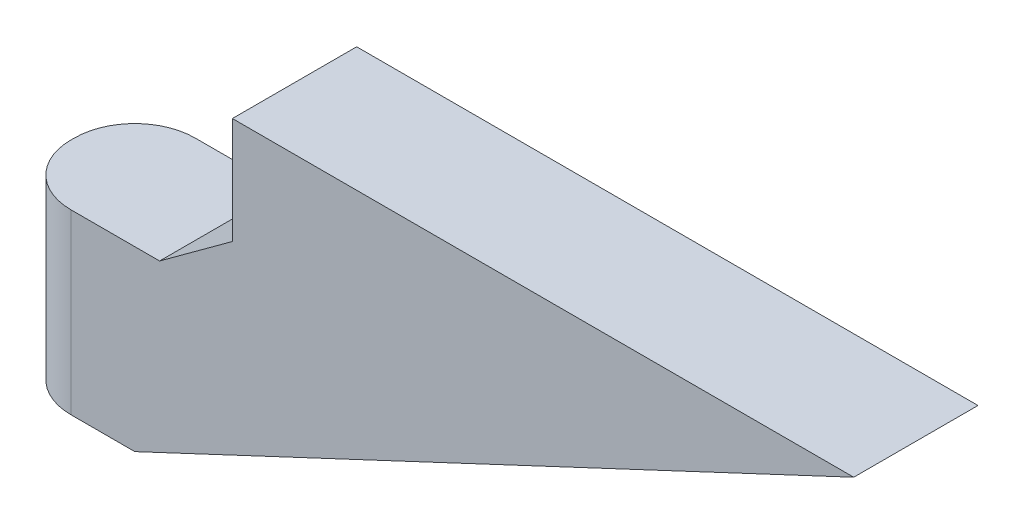
ISO-10303-21;
HEADER;
FILE_DESCRIPTION(('STEP AP214'),'2;1');
FILE_NAME('part.step','',(''),(''),'','','');
FILE_SCHEMA(('AUTOMOTIVE_DESIGN { 1 0 10303 214 1 1 1 1 }'));
ENDSEC;
DATA;
#1=APPLICATION_CONTEXT('core data for automotive mechanical design processes');
#2=APPLICATION_PROTOCOL_DEFINITION('international standard','automotive_design',2000,#1);
#3=PRODUCT_CONTEXT('',#1,'mechanical');
#4=PRODUCT('Part','Part','',(#3));
#5=PRODUCT_RELATED_PRODUCT_CATEGORY('part','',(#4));
#6=PRODUCT_DEFINITION_FORMATION('','',#4);
#7=PRODUCT_DEFINITION_CONTEXT('part definition',#1,'design');
#8=PRODUCT_DEFINITION('design','',#6,#7);
#9=PRODUCT_DEFINITION_SHAPE('','',#8);
#10=(LENGTH_UNIT() NAMED_UNIT(*) SI_UNIT(.MILLI.,.METRE.));
#11=(NAMED_UNIT(*) PLANE_ANGLE_UNIT() SI_UNIT($,.RADIAN.));
#12=(NAMED_UNIT(*) SI_UNIT($,.STERADIAN.) SOLID_ANGLE_UNIT());
#13=UNCERTAINTY_MEASURE_WITH_UNIT(LENGTH_MEASURE(1.E-05),#10,'distance_accuracy_value','');
#14=(GEOMETRIC_REPRESENTATION_CONTEXT(3) GLOBAL_UNCERTAINTY_ASSIGNED_CONTEXT((#13)) GLOBAL_UNIT_ASSIGNED_CONTEXT((#10,
#11,#12)) REPRESENTATION_CONTEXT('',''));
#15=CARTESIAN_POINT('',(0.,0.,0.));
#16=DIRECTION('',(0.,0.,1.));
#17=DIRECTION('',(1.,0.,0.));
#18=AXIS2_PLACEMENT_3D('',#15,#16,#17);
#19=CARTESIAN_POINT('',(0.,-12.065,8.89));
#20=DIRECTION('',(0.,-1.,0.));
#21=DIRECTION('',(1.,0.,0.));
#22=AXIS2_PLACEMENT_3D('',#19,#20,#21);
#23=PLANE('',#22);
#24=DIRECTION('',(0.,0.,-1.));
#25=VECTOR('',#24,1.);
#26=CARTESIAN_POINT('',(-30.1625,-12.065,8.89));
#27=LINE('',#26,#25);
#28=CARTESIAN_POINT('',(-30.1625,-12.065,4.572));
#29=VERTEX_POINT('',#28);
#30=CARTESIAN_POINT('',(-30.1625,-12.065,4.318));
#31=VERTEX_POINT('',#30);
#32=EDGE_CURVE('E148',#29,#31,#27,.T.);
#33=ORIENTED_EDGE('',*,*,#32,.T.);
#34=CARTESIAN_POINT('',(-25.8445,-12.065,4.318));
#35=DIRECTION('',(0.,-1.,0.));
#36=DIRECTION('',(1.,0.,0.));
#37=AXIS2_PLACEMENT_3D('',#34,#35,#36);
#38=CIRCLE('',#37,4.318);
#39=CARTESIAN_POINT('',(-25.8445,-12.065,0.));
#40=VERTEX_POINT('',#39);
#41=EDGE_CURVE('E178',#31,#40,#38,.T.);
#42=ORIENTED_EDGE('',*,*,#41,.T.);
#43=DIRECTION('',(-1.,0.,0.));
#44=VECTOR('',#43,1.);
#45=CARTESIAN_POINT('',(0.,-12.065,0.));
#46=LINE('',#45,#44);
#47=CARTESIAN_POINT('',(-21.2725,-12.065,0.));
#48=VERTEX_POINT('',#47);
#49=EDGE_CURVE('E119',#48,#40,#46,.T.);
#50=ORIENTED_EDGE('',*,*,#49,.F.);
#51=DIRECTION('',(0.,0.,-1.));
#52=VECTOR('',#51,1.);
#53=CARTESIAN_POINT('',(-21.2725,-12.065,8.89));
#54=LINE('',#53,#52);
#55=CARTESIAN_POINT('',(-21.2725,-12.065,8.89));
#56=VERTEX_POINT('',#55);
#57=EDGE_CURVE('E114',#56,#48,#54,.T.);
#58=ORIENTED_EDGE('',*,*,#57,.F.);
#59=DIRECTION('',(-1.,0.,0.));
#60=VECTOR('',#59,1.);
#61=CARTESIAN_POINT('',(0.,-12.065,8.89));
#62=LINE('',#61,#60);
#63=CARTESIAN_POINT('',(-25.8445,-12.065,8.89));
#64=VERTEX_POINT('',#63);
#65=EDGE_CURVE('E118',#56,#64,#62,.T.);
#66=ORIENTED_EDGE('',*,*,#65,.T.);
#67=CARTESIAN_POINT('',(-25.8445,-12.065,4.572));
#68=DIRECTION('',(0.,-1.,0.));
#69=DIRECTION('',(1.,0.,0.));
#70=AXIS2_PLACEMENT_3D('',#67,#68,#69);
#71=CIRCLE('',#70,4.318);
#72=EDGE_CURVE('E176',#64,#29,#71,.T.);
#73=ORIENTED_EDGE('',*,*,#72,.T.);
#74=EDGE_LOOP('',(#33,#42,#50,#58,#66,#73));
#75=FACE_BOUND('',#74,.T.);
#76=ADVANCED_FACE('F41',(#75),#23,.T.);
#77=CARTESIAN_POINT('',(0.80182136164897,-1.70914553404122,8.89));
#78=DIRECTION('',(-0.424720211390714,0.905324661122311,0.));
#79=DIRECTION('',(-0.905324661122311,-0.424720211390714,0.));
#80=AXIS2_PLACEMENT_3D('',#77,#78,#79);
#81=PLANE('',#80);
#82=DIRECTION('',(0.905324661122311,0.424720211390714,0.));
#83=VECTOR('',#82,1.);
#84=CARTESIAN_POINT('',(0.80182136164897,-1.70914553404122,0.));
#85=LINE('',#84,#83);
#86=CARTESIAN_POINT('',(30.1625,12.065,0.));
#87=VERTEX_POINT('',#86);
#88=EDGE_CURVE('E150',#48,#87,#85,.T.);
#89=ORIENTED_EDGE('',*,*,#88,.T.);
#90=DIRECTION('',(0.,0.,-1.));
#91=VECTOR('',#90,1.);
#92=CARTESIAN_POINT('',(30.1625,12.065,8.89));
#93=LINE('',#92,#91);
#94=CARTESIAN_POINT('',(30.1625,12.065,8.89));
#95=VERTEX_POINT('',#94);
#96=EDGE_CURVE('E123',#95,#87,#93,.T.);
#97=ORIENTED_EDGE('',*,*,#96,.F.);
#98=DIRECTION('',(0.905324661122311,0.424720211390714,0.));
#99=VECTOR('',#98,1.);
#100=CARTESIAN_POINT('',(0.80182136164897,-1.70914553404122,8.89));
#101=LINE('',#100,#99);
#102=EDGE_CURVE('E126',#56,#95,#101,.T.);
#103=ORIENTED_EDGE('',*,*,#102,.F.);
#104=ORIENTED_EDGE('',*,*,#57,.T.);
#105=EDGE_LOOP('',(#89,#97,#103,#104));
#106=FACE_BOUND('',#105,.T.);
#107=ADVANCED_FACE('F127',(#106),#81,.F.);
#108=CARTESIAN_POINT('',(0.,12.065,8.89));
#109=DIRECTION('',(0.,-1.,0.));
#110=DIRECTION('',(1.,0.,0.));
#111=AXIS2_PLACEMENT_3D('',#108,#109,#110);
#112=PLANE('',#111);
#113=DIRECTION('',(-1.,0.,0.));
#114=VECTOR('',#113,1.);
#115=CARTESIAN_POINT('',(0.,12.065,0.));
#116=LINE('',#115,#114);
#117=CARTESIAN_POINT('',(-14.2875,12.065,0.));
#118=VERTEX_POINT('',#117);
#119=EDGE_CURVE('E152',#87,#118,#116,.T.);
#120=ORIENTED_EDGE('',*,*,#119,.T.);
#121=DIRECTION('',(0.,0.,-1.));
#122=VECTOR('',#121,1.);
#123=CARTESIAN_POINT('',(-14.2875,12.065,8.89));
#124=LINE('',#123,#122);
#125=CARTESIAN_POINT('',(-14.2875,12.065,8.89));
#126=VERTEX_POINT('',#125);
#127=EDGE_CURVE('E168',#126,#118,#124,.T.);
#128=ORIENTED_EDGE('',*,*,#127,.F.);
#129=DIRECTION('',(-1.,0.,0.));
#130=VECTOR('',#129,1.);
#131=CARTESIAN_POINT('',(0.,12.065,8.89));
#132=LINE('',#131,#130);
#133=EDGE_CURVE('E131',#95,#126,#132,.T.);
#134=ORIENTED_EDGE('',*,*,#133,.F.);
#135=ORIENTED_EDGE('',*,*,#96,.T.);
#136=EDGE_LOOP('',(#120,#128,#134,#135));
#137=FACE_BOUND('',#136,.T.);
#138=ADVANCED_FACE('F194',(#137),#112,.F.);
#139=CARTESIAN_POINT('',(-14.2875,0.,8.89));
#140=DIRECTION('',(1.,0.,0.));
#141=DIRECTION('',(0.,1.,0.));
#142=AXIS2_PLACEMENT_3D('',#139,#140,#141);
#143=PLANE('',#142);
#144=DIRECTION('',(0.,-1.,0.));
#145=VECTOR('',#144,1.);
#146=CARTESIAN_POINT('',(-14.2875,0.,0.));
#147=LINE('',#146,#145);
#148=CARTESIAN_POINT('',(-14.2875,4.445,0.));
#149=VERTEX_POINT('',#148);
#150=EDGE_CURVE('E154',#118,#149,#147,.T.);
#151=ORIENTED_EDGE('',*,*,#150,.T.);
#152=DIRECTION('',(0.,0.,-1.));
#153=VECTOR('',#152,1.);
#154=CARTESIAN_POINT('',(-14.2875,4.445,8.89));
#155=LINE('',#154,#153);
#156=CARTESIAN_POINT('',(-14.2875,4.445,8.89));
#157=VERTEX_POINT('',#156);
#158=EDGE_CURVE('E165',#157,#149,#155,.T.);
#159=ORIENTED_EDGE('',*,*,#158,.F.);
#160=DIRECTION('',(0.,-1.,0.));
#161=VECTOR('',#160,1.);
#162=CARTESIAN_POINT('',(-14.2875,0.,8.89));
#163=LINE('',#162,#161);
#164=EDGE_CURVE('E141',#126,#157,#163,.T.);
#165=ORIENTED_EDGE('',*,*,#164,.F.);
#166=ORIENTED_EDGE('',*,*,#127,.T.);
#167=EDGE_LOOP('',(#151,#159,#165,#166));
#168=FACE_BOUND('',#167,.T.);
#169=ADVANCED_FACE('F201',(#168),#143,.F.);
#170=CARTESIAN_POINT('',(-7.10038744672608,9.70386284385897,8.89));
#171=DIRECTION('',(0.590509994384218,-0.80703032565843,0.));
#172=DIRECTION('',(0.80703032565843,0.590509994384218,0.));
#173=AXIS2_PLACEMENT_3D('',#170,#171,#172);
#174=PLANE('',#173);
#175=DIRECTION('',(-0.80703032565843,-0.590509994384218,0.));
#176=VECTOR('',#175,1.);
#177=CARTESIAN_POINT('',(-7.10038744672608,9.70386284385897,0.));
#178=LINE('',#177,#176);
#179=CARTESIAN_POINT('',(-19.4945,0.634999999999997,0.));
#180=VERTEX_POINT('',#179);
#181=EDGE_CURVE('E137',#149,#180,#178,.T.);
#182=ORIENTED_EDGE('',*,*,#181,.T.);
#183=DIRECTION('',(0.,0.,-1.));
#184=VECTOR('',#183,1.);
#185=CARTESIAN_POINT('',(-19.4945,0.634999999999997,8.89));
#186=LINE('',#185,#184);
#187=CARTESIAN_POINT('',(-19.4945,0.634999999999997,8.89));
#188=VERTEX_POINT('',#187);
#189=EDGE_CURVE('E162',#188,#180,#186,.T.);
#190=ORIENTED_EDGE('',*,*,#189,.F.);
#191=DIRECTION('',(-0.80703032565843,-0.590509994384218,0.));
#192=VECTOR('',#191,1.);
#193=CARTESIAN_POINT('',(-7.10038744672608,9.70386284385897,8.89));
#194=LINE('',#193,#192);
#195=EDGE_CURVE('E143',#157,#188,#194,.T.);
#196=ORIENTED_EDGE('',*,*,#195,.F.);
#197=ORIENTED_EDGE('',*,*,#158,.T.);
#198=EDGE_LOOP('',(#182,#190,#196,#197));
#199=FACE_BOUND('',#198,.T.);
#200=ADVANCED_FACE('F204',(#199),#174,.F.);
#201=CARTESIAN_POINT('',(0.,0.634999999999997,8.89));
#202=DIRECTION('',(0.,1.,0.));
#203=DIRECTION('',(0.,0.,1.));
#204=AXIS2_PLACEMENT_3D('',#201,#202,#203);
#205=PLANE('',#204);
#206=DIRECTION('',(1.,0.,0.));
#207=VECTOR('',#206,1.);
#208=CARTESIAN_POINT('',(0.,0.634999999999997,0.));
#209=LINE('',#208,#207);
#210=CARTESIAN_POINT('',(-25.8445,0.634999999999997,0.));
#211=VERTEX_POINT('',#210);
#212=EDGE_CURVE('E135',#211,#180,#209,.T.);
#213=ORIENTED_EDGE('',*,*,#212,.F.);
#214=CARTESIAN_POINT('',(-25.8445,0.634999999999997,4.318));
#215=DIRECTION('',(0.,1.,0.));
#216=DIRECTION('',(0.,0.,1.));
#217=AXIS2_PLACEMENT_3D('',#214,#215,#216);
#218=CIRCLE('',#217,4.318);
#219=CARTESIAN_POINT('',(-30.1625,0.634999999999997,4.318));
#220=VERTEX_POINT('',#219);
#221=EDGE_CURVE('E49',#211,#220,#218,.T.);
#222=ORIENTED_EDGE('',*,*,#221,.T.);
#223=DIRECTION('',(0.,0.,-1.));
#224=VECTOR('',#223,1.);
#225=CARTESIAN_POINT('',(-30.1625,0.634999999999997,8.89));
#226=LINE('',#225,#224);
#227=CARTESIAN_POINT('',(-30.1625,0.634999999999997,4.572));
#228=VERTEX_POINT('',#227);
#229=EDGE_CURVE('E159',#228,#220,#226,.T.);
#230=ORIENTED_EDGE('',*,*,#229,.F.);
#231=CARTESIAN_POINT('',(-25.8445,0.634999999999997,4.572));
#232=DIRECTION('',(0.,1.,0.));
#233=DIRECTION('',(0.,0.,1.));
#234=AXIS2_PLACEMENT_3D('',#231,#232,#233);
#235=CIRCLE('',#234,4.318);
#236=CARTESIAN_POINT('',(-25.8445,0.634999999999997,8.89));
#237=VERTEX_POINT('',#236);
#238=EDGE_CURVE('E56',#228,#237,#235,.T.);
#239=ORIENTED_EDGE('',*,*,#238,.T.);
#240=DIRECTION('',(1.,0.,0.));
#241=VECTOR('',#240,1.);
#242=CARTESIAN_POINT('',(0.,0.634999999999997,8.89));
#243=LINE('',#242,#241);
#244=EDGE_CURVE('E146',#237,#188,#243,.T.);
#245=ORIENTED_EDGE('',*,*,#244,.T.);
#246=ORIENTED_EDGE('',*,*,#189,.T.);
#247=EDGE_LOOP('',(#213,#222,#230,#239,#245,#246));
#248=FACE_BOUND('',#247,.T.);
#249=ADVANCED_FACE('F182',(#248),#205,.T.);
#250=CARTESIAN_POINT('',(-30.1625,0.,8.89));
#251=DIRECTION('',(1.,0.,0.));
#252=DIRECTION('',(0.,1.,0.));
#253=AXIS2_PLACEMENT_3D('',#250,#251,#252);
#254=PLANE('',#253);
#255=ORIENTED_EDGE('',*,*,#229,.T.);
#256=DIRECTION('',(0.,-1.,0.));
#257=VECTOR('',#256,1.);
#258=CARTESIAN_POINT('',(-30.1625,0.,4.318));
#259=LINE('',#258,#257);
#260=EDGE_CURVE('E173',#220,#31,#259,.T.);
#261=ORIENTED_EDGE('',*,*,#260,.T.);
#262=ORIENTED_EDGE('',*,*,#32,.F.);
#263=DIRECTION('',(0.,-1.,0.));
#264=VECTOR('',#263,1.);
#265=CARTESIAN_POINT('',(-30.1625,0.634999999999997,4.572));
#266=LINE('',#265,#264);
#267=EDGE_CURVE('E122',#29,#228,#266,.F.);
#268=ORIENTED_EDGE('',*,*,#267,.T.);
#269=EDGE_LOOP('',(#255,#261,#262,#268));
#270=FACE_BOUND('',#269,.T.);
#271=ADVANCED_FACE('F186',(#270),#254,.F.);
#272=CARTESIAN_POINT('',(0.,0.,8.89));
#273=DIRECTION('',(0.,0.,1.));
#274=DIRECTION('',(1.,0.,0.));
#275=AXIS2_PLACEMENT_3D('',#272,#273,#274);
#276=PLANE('',#275);
#277=ORIENTED_EDGE('',*,*,#244,.F.);
#278=DIRECTION('',(0.,-1.,0.));
#279=VECTOR('',#278,1.);
#280=CARTESIAN_POINT('',(-25.8445,-12.065,8.89));
#281=LINE('',#280,#279);
#282=EDGE_CURVE('E11',#237,#64,#281,.T.);
#283=ORIENTED_EDGE('',*,*,#282,.T.);
#284=ORIENTED_EDGE('',*,*,#65,.F.);
#285=ORIENTED_EDGE('',*,*,#102,.T.);
#286=ORIENTED_EDGE('',*,*,#133,.T.);
#287=ORIENTED_EDGE('',*,*,#164,.T.);
#288=ORIENTED_EDGE('',*,*,#195,.T.);
#289=EDGE_LOOP('',(#277,#283,#284,#285,#286,#287,#288));
#290=FACE_BOUND('',#289,.T.);
#291=ADVANCED_FACE('F133',(#290),#276,.T.);
#292=CARTESIAN_POINT('',(0.,0.,0.));
#293=DIRECTION('',(0.,0.,1.));
#294=DIRECTION('',(1.,0.,0.));
#295=AXIS2_PLACEMENT_3D('',#292,#293,#294);
#296=PLANE('',#295);
#297=ORIENTED_EDGE('',*,*,#49,.T.);
#298=DIRECTION('',(0.,-1.,0.));
#299=VECTOR('',#298,1.);
#300=CARTESIAN_POINT('',(-25.8445,0.,0.));
#301=LINE('',#300,#299);
#302=EDGE_CURVE('E64',#40,#211,#301,.F.);
#303=ORIENTED_EDGE('',*,*,#302,.T.);
#304=ORIENTED_EDGE('',*,*,#212,.T.);
#305=ORIENTED_EDGE('',*,*,#181,.F.);
#306=ORIENTED_EDGE('',*,*,#150,.F.);
#307=ORIENTED_EDGE('',*,*,#119,.F.);
#308=ORIENTED_EDGE('',*,*,#88,.F.);
#309=EDGE_LOOP('',(#297,#303,#304,#305,#306,#307,#308));
#310=FACE_BOUND('',#309,.T.);
#311=ADVANCED_FACE('F190',(#310),#296,.F.);
#312=CARTESIAN_POINT('',(-25.8445,0.,4.318));
#313=DIRECTION('',(0.,-1.,0.));
#314=DIRECTION('',(1.,0.,0.));
#315=AXIS2_PLACEMENT_3D('',#312,#313,#314);
#316=CYLINDRICAL_SURFACE('',#315,4.318);
#317=ORIENTED_EDGE('',*,*,#221,.F.);
#318=ORIENTED_EDGE('',*,*,#302,.F.);
#319=ORIENTED_EDGE('',*,*,#41,.F.);
#320=ORIENTED_EDGE('',*,*,#260,.F.);
#321=EDGE_LOOP('',(#317,#318,#319,#320));
#322=FACE_BOUND('',#321,.T.);
#323=ADVANCED_FACE('F189',(#322),#316,.T.);
#324=CARTESIAN_POINT('',(-25.8445,0.,4.572));
#325=DIRECTION('',(0.,1.,0.));
#326=DIRECTION('',(-1.,0.,0.));
#327=AXIS2_PLACEMENT_3D('',#324,#325,#326);
#328=CYLINDRICAL_SURFACE('',#327,4.318);
#329=ORIENTED_EDGE('',*,*,#238,.F.);
#330=ORIENTED_EDGE('',*,*,#267,.F.);
#331=ORIENTED_EDGE('',*,*,#72,.F.);
#332=ORIENTED_EDGE('',*,*,#282,.F.);
#333=EDGE_LOOP('',(#329,#330,#331,#332));
#334=FACE_BOUND('',#333,.T.);
#335=ADVANCED_FACE('F43',(#334),#328,.T.);
#336=CLOSED_SHELL('',(#76,#107,#138,#169,#200,#249,#271,#291,#311,#323,#335));
#337=MANIFOLD_SOLID_BREP('B2',#336);
#338=ADVANCED_BREP_SHAPE_REPRESENTATION('',(#18,#337),#14);
#339=SHAPE_DEFINITION_REPRESENTATION(#9,#338);
ENDSEC;
END-ISO-10303-21;
